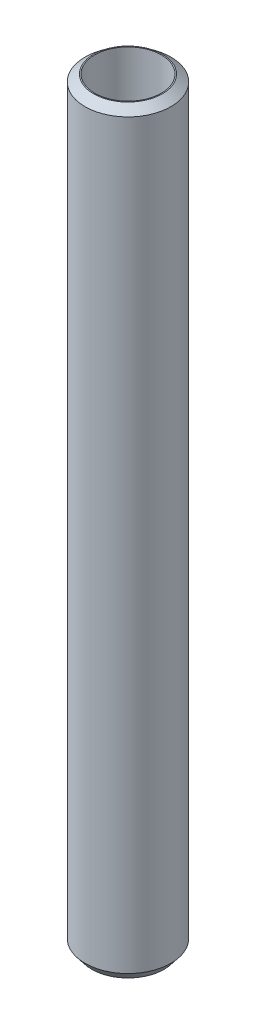
ISO-10303-21;
HEADER;
FILE_DESCRIPTION(('STEP AP214'),'2;1');
FILE_NAME('part.step','',(''),(''),'','','');
FILE_SCHEMA(('AUTOMOTIVE_DESIGN { 1 0 10303 214 1 1 1 1 }'));
ENDSEC;
DATA;
#1=APPLICATION_CONTEXT('core data for automotive mechanical design processes');
#2=APPLICATION_PROTOCOL_DEFINITION('international standard','automotive_design',2000,#1);
#3=PRODUCT_CONTEXT('',#1,'mechanical');
#4=PRODUCT('Part','Part','',(#3));
#5=PRODUCT_RELATED_PRODUCT_CATEGORY('part','',(#4));
#6=PRODUCT_DEFINITION_FORMATION('','',#4);
#7=PRODUCT_DEFINITION_CONTEXT('part definition',#1,'design');
#8=PRODUCT_DEFINITION('design','',#6,#7);
#9=PRODUCT_DEFINITION_SHAPE('','',#8);
#10=(LENGTH_UNIT() NAMED_UNIT(*) SI_UNIT(.MILLI.,.METRE.));
#11=(NAMED_UNIT(*) PLANE_ANGLE_UNIT() SI_UNIT($,.RADIAN.));
#12=(NAMED_UNIT(*) SI_UNIT($,.STERADIAN.) SOLID_ANGLE_UNIT());
#13=UNCERTAINTY_MEASURE_WITH_UNIT(LENGTH_MEASURE(1.E-05),#10,'distance_accuracy_value','');
#14=(GEOMETRIC_REPRESENTATION_CONTEXT(3) GLOBAL_UNCERTAINTY_ASSIGNED_CONTEXT((#13)) GLOBAL_UNIT_ASSIGNED_CONTEXT((#10,
#11,#12)) REPRESENTATION_CONTEXT('',''));
#15=CARTESIAN_POINT('',(0.,0.,0.));
#16=DIRECTION('',(0.,0.,1.));
#17=DIRECTION('',(1.,0.,0.));
#18=AXIS2_PLACEMENT_3D('',#15,#16,#17);
#19=CARTESIAN_POINT('',(0.,484.599302331375,0.));
#20=DIRECTION('',(0.,-1.,0.));
#21=DIRECTION('',(0.,0.,-1.));
#22=AXIS2_PLACEMENT_3D('',#19,#20,#21);
#23=CYLINDRICAL_SURFACE('',#22,27.5);
#24=CARTESIAN_POINT('',(0.,480.270809528134,0.));
#25=DIRECTION('',(0.,1.,0.));
#26=DIRECTION('',(0.,0.,1.));
#27=AXIS2_PLACEMENT_3D('',#24,#25,#26);
#28=CIRCLE('',#27,27.5);
#29=CARTESIAN_POINT('',(0.,480.270809528134,27.5));
#30=VERTEX_POINT('',#29);
#31=EDGE_CURVE('E50',#30,#30,#28,.F.);
#32=ORIENTED_EDGE('',*,*,#31,.T.);
#33=EDGE_LOOP('',(#32));
#34=FACE_BOUND('',#33,.T.);
#35=CARTESIAN_POINT('',(0.,5.5173563653087,0.));
#36=DIRECTION('',(0.,1.,0.));
#37=DIRECTION('',(0.,0.,1.));
#38=AXIS2_PLACEMENT_3D('',#35,#36,#37);
#39=CIRCLE('',#38,27.5);
#40=CARTESIAN_POINT('',(0.,5.5173563653087,27.5));
#41=VERTEX_POINT('',#40);
#42=EDGE_CURVE('E51',#41,#41,#39,.T.);
#43=ORIENTED_EDGE('',*,*,#42,.T.);
#44=EDGE_LOOP('',(#43));
#45=FACE_BOUND('',#44,.T.);
#46=ADVANCED_FACE('F39',(#34,#45),#23,.T.);
#47=CARTESIAN_POINT('',(0.,484.599302331375,0.));
#48=DIRECTION('',(0.,1.,0.));
#49=DIRECTION('',(0.,0.,1.));
#50=AXIS2_PLACEMENT_3D('',#47,#48,#49);
#51=PLANE('',#50);
#52=CARTESIAN_POINT('',(0.,484.599302331375,0.));
#53=DIRECTION('',(0.,1.,0.));
#54=DIRECTION('',(0.,0.,1.));
#55=AXIS2_PLACEMENT_3D('',#52,#53,#54);
#56=CIRCLE('',#55,21.9826436346912);
#57=CARTESIAN_POINT('',(0.,484.599302331375,21.9826436346912));
#58=VERTEX_POINT('',#57);
#59=EDGE_CURVE('E54',#58,#58,#56,.T.);
#60=ORIENTED_EDGE('',*,*,#59,.T.);
#61=EDGE_LOOP('',(#60));
#62=FACE_BOUND('',#61,.T.);
#63=CARTESIAN_POINT('',(0.,484.599302331375,0.));
#64=DIRECTION('',(0.,1.,0.));
#65=DIRECTION('',(0.,0.,1.));
#66=AXIS2_PLACEMENT_3D('',#63,#64,#65);
#67=CIRCLE('',#66,21.2873747400145);
#68=CARTESIAN_POINT('',(0.,484.599302331375,21.2873747400145));
#69=VERTEX_POINT('',#68);
#70=EDGE_CURVE('E58',#69,#69,#67,.T.);
#71=ORIENTED_EDGE('',*,*,#70,.F.);
#72=EDGE_LOOP('',(#71));
#73=FACE_BOUND('',#72,.T.);
#74=ADVANCED_FACE('F69',(#62,#73),#51,.T.);
#75=CARTESIAN_POINT('',(0.,0.,0.));
#76=DIRECTION('',(0.,1.,0.));
#77=DIRECTION('',(0.,0.,1.));
#78=AXIS2_PLACEMENT_3D('',#75,#76,#77);
#79=PLANE('',#78);
#80=CARTESIAN_POINT('',(0.,0.,0.));
#81=DIRECTION('',(0.,1.,0.));
#82=DIRECTION('',(0.,0.,1.));
#83=AXIS2_PLACEMENT_3D('',#80,#81,#82);
#84=CIRCLE('',#83,23.1715071967582);
#85=CARTESIAN_POINT('',(0.,0.,23.1715071967582));
#86=VERTEX_POINT('',#85);
#87=EDGE_CURVE('E10',#86,#86,#84,.F.);
#88=ORIENTED_EDGE('',*,*,#87,.T.);
#89=EDGE_LOOP('',(#88));
#90=FACE_BOUND('',#89,.T.);
#91=CARTESIAN_POINT('',(0.,0.,0.));
#92=DIRECTION('',(0.,1.,0.));
#93=DIRECTION('',(0.,0.,1.));
#94=AXIS2_PLACEMENT_3D('',#91,#92,#93);
#95=CIRCLE('',#94,21.2873747400145);
#96=CARTESIAN_POINT('',(0.,0.,21.2873747400145));
#97=VERTEX_POINT('',#96);
#98=EDGE_CURVE('E63',#97,#97,#95,.T.);
#99=ORIENTED_EDGE('',*,*,#98,.T.);
#100=EDGE_LOOP('',(#99));
#101=FACE_BOUND('',#100,.T.);
#102=ADVANCED_FACE('F75',(#90,#101),#79,.F.);
#103=CARTESIAN_POINT('',(0.,484.599302331375,0.));
#104=DIRECTION('',(0.,-1.,0.));
#105=DIRECTION('',(0.,0.,-1.));
#106=AXIS2_PLACEMENT_3D('',#103,#104,#105);
#107=CYLINDRICAL_SURFACE('',#106,21.2873747400145);
#108=ORIENTED_EDGE('',*,*,#70,.T.);
#109=EDGE_LOOP('',(#108));
#110=FACE_BOUND('',#109,.T.);
#111=ORIENTED_EDGE('',*,*,#98,.F.);
#112=EDGE_LOOP('',(#111));
#113=FACE_BOUND('',#112,.T.);
#114=ADVANCED_FACE('F70',(#110,#113),#107,.F.);
#115=CARTESIAN_POINT('',(0.,484.599302331375,0.));
#116=DIRECTION('',(0.,-1.,0.));
#117=DIRECTION('',(0.,0.,-1.));
#118=AXIS2_PLACEMENT_3D('',#115,#116,#117);
#119=CONICAL_SURFACE('',#118,21.9826436346912,0.905564102088076);
#120=ORIENTED_EDGE('',*,*,#31,.F.);
#121=EDGE_LOOP('',(#120));
#122=FACE_BOUND('',#121,.T.);
#123=ORIENTED_EDGE('',*,*,#59,.F.);
#124=EDGE_LOOP('',(#123));
#125=FACE_BOUND('',#124,.T.);
#126=ADVANCED_FACE('F81',(#122,#125),#119,.T.);
#127=CARTESIAN_POINT('',(0.,5.5173563653087,0.));
#128=DIRECTION('',(0.,1.,0.));
#129=DIRECTION('',(0.,0.,1.));
#130=AXIS2_PLACEMENT_3D('',#127,#128,#129);
#131=CONICAL_SURFACE('',#130,27.5,0.665232224706826);
#132=ORIENTED_EDGE('',*,*,#87,.F.);
#133=EDGE_LOOP('',(#132));
#134=FACE_BOUND('',#133,.T.);
#135=ORIENTED_EDGE('',*,*,#42,.F.);
#136=EDGE_LOOP('',(#135));
#137=FACE_BOUND('',#136,.T.);
#138=ADVANCED_FACE('F45',(#134,#137),#131,.T.);
#139=CLOSED_SHELL('',(#46,#74,#102,#114,#126,#138));
#140=MANIFOLD_SOLID_BREP('B2',#139);
#141=ADVANCED_BREP_SHAPE_REPRESENTATION('',(#18,#140),#14);
#142=SHAPE_DEFINITION_REPRESENTATION(#9,#141);
ENDSEC;
END-ISO-10303-21;
